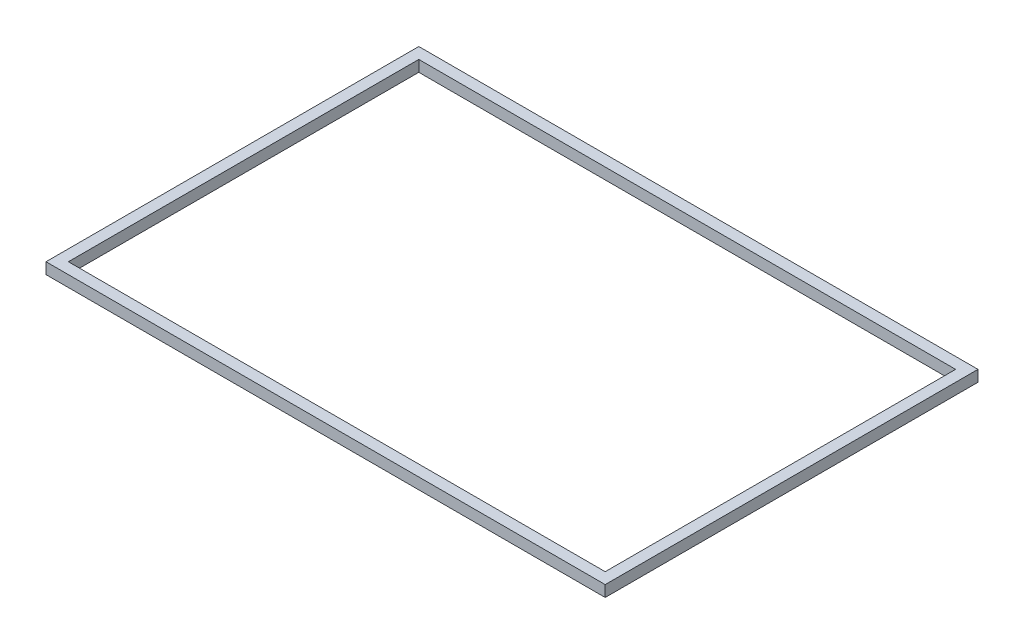
ISO-10303-21;
HEADER;
FILE_DESCRIPTION(('STEP AP214'),'2;1');
FILE_NAME('part.step','',(''),(''),'','','');
FILE_SCHEMA(('AUTOMOTIVE_DESIGN { 1 0 10303 214 1 1 1 1 }'));
ENDSEC;
DATA;
#1=APPLICATION_CONTEXT('core data for automotive mechanical design processes');
#2=APPLICATION_PROTOCOL_DEFINITION('international standard','automotive_design',2000,#1);
#3=PRODUCT_CONTEXT('',#1,'mechanical');
#4=PRODUCT('Part','Part','',(#3));
#5=PRODUCT_RELATED_PRODUCT_CATEGORY('part','',(#4));
#6=PRODUCT_DEFINITION_FORMATION('','',#4);
#7=PRODUCT_DEFINITION_CONTEXT('part definition',#1,'design');
#8=PRODUCT_DEFINITION('design','',#6,#7);
#9=PRODUCT_DEFINITION_SHAPE('','',#8);
#10=(LENGTH_UNIT() NAMED_UNIT(*) SI_UNIT(.MILLI.,.METRE.));
#11=(NAMED_UNIT(*) PLANE_ANGLE_UNIT() SI_UNIT($,.RADIAN.));
#12=(NAMED_UNIT(*) SI_UNIT($,.STERADIAN.) SOLID_ANGLE_UNIT());
#13=UNCERTAINTY_MEASURE_WITH_UNIT(LENGTH_MEASURE(1.E-05),#10,'distance_accuracy_value','');
#14=(GEOMETRIC_REPRESENTATION_CONTEXT(3) GLOBAL_UNCERTAINTY_ASSIGNED_CONTEXT((#13)) GLOBAL_UNIT_ASSIGNED_CONTEXT((#10,
#11,#12)) REPRESENTATION_CONTEXT('',''));
#15=CARTESIAN_POINT('',(0.,0.,0.));
#16=DIRECTION('',(0.,0.,1.));
#17=DIRECTION('',(1.,0.,0.));
#18=AXIS2_PLACEMENT_3D('',#15,#16,#17);
#19=CARTESIAN_POINT('',(0.,3.,0.));
#20=DIRECTION('',(0.,0.,-1.));
#21=DIRECTION('',(-1.,0.,0.));
#22=AXIS2_PLACEMENT_3D('',#19,#20,#21);
#23=PLANE('',#22);
#24=DIRECTION('',(1.,0.,0.));
#25=VECTOR('',#24,1.);
#26=CARTESIAN_POINT('',(0.,0.,0.));
#27=LINE('',#26,#25);
#28=CARTESIAN_POINT('',(0.,0.,0.));
#29=VERTEX_POINT('',#28);
#30=CARTESIAN_POINT('',(150.,0.,0.));
#31=VERTEX_POINT('',#30);
#32=EDGE_CURVE('E140',#29,#31,#27,.T.);
#33=ORIENTED_EDGE('',*,*,#32,.T.);
#34=DIRECTION('',(0.,-1.,0.));
#35=VECTOR('',#34,1.);
#36=CARTESIAN_POINT('',(150.,3.,0.));
#37=LINE('',#36,#35);
#38=CARTESIAN_POINT('',(150.,3.,0.));
#39=VERTEX_POINT('',#38);
#40=EDGE_CURVE('E11',#39,#31,#37,.T.);
#41=ORIENTED_EDGE('',*,*,#40,.F.);
#42=DIRECTION('',(1.,0.,0.));
#43=VECTOR('',#42,1.);
#44=CARTESIAN_POINT('',(0.,3.,0.));
#45=LINE('',#44,#43);
#46=CARTESIAN_POINT('',(0.,3.,0.));
#47=VERTEX_POINT('',#46);
#48=EDGE_CURVE('E112',#47,#39,#45,.T.);
#49=ORIENTED_EDGE('',*,*,#48,.F.);
#50=DIRECTION('',(0.,-1.,0.));
#51=VECTOR('',#50,1.);
#52=CARTESIAN_POINT('',(0.,3.,0.));
#53=LINE('',#52,#51);
#54=EDGE_CURVE('E52',#47,#29,#53,.T.);
#55=ORIENTED_EDGE('',*,*,#54,.T.);
#56=EDGE_LOOP('',(#33,#41,#49,#55));
#57=FACE_BOUND('',#56,.T.);
#58=ADVANCED_FACE('F33',(#57),#23,.F.);
#59=CARTESIAN_POINT('',(150.,3.,0.));
#60=DIRECTION('',(-1.,0.,0.));
#61=DIRECTION('',(0.,0.,1.));
#62=AXIS2_PLACEMENT_3D('',#59,#60,#61);
#63=PLANE('',#62);
#64=DIRECTION('',(0.,0.,-1.));
#65=VECTOR('',#64,1.);
#66=CARTESIAN_POINT('',(150.,0.,0.));
#67=LINE('',#66,#65);
#68=CARTESIAN_POINT('',(150.,0.,-100.));
#69=VERTEX_POINT('',#68);
#70=EDGE_CURVE('E118',#31,#69,#67,.T.);
#71=ORIENTED_EDGE('',*,*,#70,.T.);
#72=DIRECTION('',(0.,-1.,0.));
#73=VECTOR('',#72,1.);
#74=CARTESIAN_POINT('',(150.,3.,-100.));
#75=LINE('',#74,#73);
#76=CARTESIAN_POINT('',(150.,3.,-100.));
#77=VERTEX_POINT('',#76);
#78=EDGE_CURVE('E43',#77,#69,#75,.T.);
#79=ORIENTED_EDGE('',*,*,#78,.F.);
#80=DIRECTION('',(0.,0.,-1.));
#81=VECTOR('',#80,1.);
#82=CARTESIAN_POINT('',(150.,3.,0.));
#83=LINE('',#82,#81);
#84=EDGE_CURVE('E106',#39,#77,#83,.T.);
#85=ORIENTED_EDGE('',*,*,#84,.F.);
#86=ORIENTED_EDGE('',*,*,#40,.T.);
#87=EDGE_LOOP('',(#71,#79,#85,#86));
#88=FACE_BOUND('',#87,.T.);
#89=ADVANCED_FACE('F117',(#88),#63,.F.);
#90=CARTESIAN_POINT('',(0.,3.,-100.));
#91=DIRECTION('',(0.,0.,-1.));
#92=DIRECTION('',(-1.,0.,0.));
#93=AXIS2_PLACEMENT_3D('',#90,#91,#92);
#94=PLANE('',#93);
#95=DIRECTION('',(1.,0.,0.));
#96=VECTOR('',#95,1.);
#97=CARTESIAN_POINT('',(0.,0.,-100.));
#98=LINE('',#97,#96);
#99=CARTESIAN_POINT('',(0.,0.,-100.));
#100=VERTEX_POINT('',#99);
#101=EDGE_CURVE('E143',#100,#69,#98,.T.);
#102=ORIENTED_EDGE('',*,*,#101,.F.);
#103=DIRECTION('',(0.,-1.,0.));
#104=VECTOR('',#103,1.);
#105=CARTESIAN_POINT('',(0.,3.,-100.));
#106=LINE('',#105,#104);
#107=CARTESIAN_POINT('',(0.,3.,-100.));
#108=VERTEX_POINT('',#107);
#109=EDGE_CURVE('E78',#108,#100,#106,.T.);
#110=ORIENTED_EDGE('',*,*,#109,.F.);
#111=DIRECTION('',(1.,0.,0.));
#112=VECTOR('',#111,1.);
#113=CARTESIAN_POINT('',(0.,3.,-100.));
#114=LINE('',#113,#112);
#115=EDGE_CURVE('E111',#108,#77,#114,.T.);
#116=ORIENTED_EDGE('',*,*,#115,.T.);
#117=ORIENTED_EDGE('',*,*,#78,.T.);
#118=EDGE_LOOP('',(#102,#110,#116,#117));
#119=FACE_BOUND('',#118,.T.);
#120=ADVANCED_FACE('F122',(#119),#94,.T.);
#121=CARTESIAN_POINT('',(0.,3.,-3.));
#122=DIRECTION('',(0.,0.,-1.));
#123=DIRECTION('',(-1.,0.,0.));
#124=AXIS2_PLACEMENT_3D('',#121,#122,#123);
#125=PLANE('',#124);
#126=DIRECTION('',(1.,0.,0.));
#127=VECTOR('',#126,1.);
#128=CARTESIAN_POINT('',(0.,0.,-3.));
#129=LINE('',#128,#127);
#130=CARTESIAN_POINT('',(3.,0.,-3.));
#131=VERTEX_POINT('',#130);
#132=CARTESIAN_POINT('',(147.,0.,-3.));
#133=VERTEX_POINT('',#132);
#134=EDGE_CURVE('E129',#131,#133,#129,.T.);
#135=ORIENTED_EDGE('',*,*,#134,.F.);
#136=DIRECTION('',(0.,-1.,0.));
#137=VECTOR('',#136,1.);
#138=CARTESIAN_POINT('',(3.,3.,-3.));
#139=LINE('',#138,#137);
#140=CARTESIAN_POINT('',(3.,3.,-3.));
#141=VERTEX_POINT('',#140);
#142=EDGE_CURVE('E37',#141,#131,#139,.T.);
#143=ORIENTED_EDGE('',*,*,#142,.F.);
#144=DIRECTION('',(1.,0.,0.));
#145=VECTOR('',#144,1.);
#146=CARTESIAN_POINT('',(0.,3.,-3.));
#147=LINE('',#146,#145);
#148=CARTESIAN_POINT('',(147.,3.,-3.));
#149=VERTEX_POINT('',#148);
#150=EDGE_CURVE('E148',#141,#149,#147,.T.);
#151=ORIENTED_EDGE('',*,*,#150,.T.);
#152=DIRECTION('',(0.,-1.,0.));
#153=VECTOR('',#152,1.);
#154=CARTESIAN_POINT('',(147.,3.,-3.));
#155=LINE('',#154,#153);
#156=EDGE_CURVE('E125',#149,#133,#155,.T.);
#157=ORIENTED_EDGE('',*,*,#156,.T.);
#158=EDGE_LOOP('',(#135,#143,#151,#157));
#159=FACE_BOUND('',#158,.T.);
#160=ADVANCED_FACE('F35',(#159),#125,.T.);
#161=CARTESIAN_POINT('',(3.,3.,0.));
#162=DIRECTION('',(-1.,0.,0.));
#163=DIRECTION('',(0.,0.,1.));
#164=AXIS2_PLACEMENT_3D('',#161,#162,#163);
#165=PLANE('',#164);
#166=DIRECTION('',(0.,0.,-1.));
#167=VECTOR('',#166,1.);
#168=CARTESIAN_POINT('',(3.,0.,0.));
#169=LINE('',#168,#167);
#170=CARTESIAN_POINT('',(3.,0.,-97.));
#171=VERTEX_POINT('',#170);
#172=EDGE_CURVE('E132',#131,#171,#169,.T.);
#173=ORIENTED_EDGE('',*,*,#172,.T.);
#174=DIRECTION('',(0.,-1.,0.));
#175=VECTOR('',#174,1.);
#176=CARTESIAN_POINT('',(3.,3.,-97.));
#177=LINE('',#176,#175);
#178=CARTESIAN_POINT('',(3.,3.,-97.));
#179=VERTEX_POINT('',#178);
#180=EDGE_CURVE('E153',#179,#171,#177,.T.);
#181=ORIENTED_EDGE('',*,*,#180,.F.);
#182=DIRECTION('',(0.,0.,-1.));
#183=VECTOR('',#182,1.);
#184=CARTESIAN_POINT('',(3.,3.,0.));
#185=LINE('',#184,#183);
#186=EDGE_CURVE('E162',#141,#179,#185,.T.);
#187=ORIENTED_EDGE('',*,*,#186,.F.);
#188=ORIENTED_EDGE('',*,*,#142,.T.);
#189=EDGE_LOOP('',(#173,#181,#187,#188));
#190=FACE_BOUND('',#189,.T.);
#191=ADVANCED_FACE('F161',(#190),#165,.F.);
#192=CARTESIAN_POINT('',(0.,3.,-97.));
#193=DIRECTION('',(0.,0.,-1.));
#194=DIRECTION('',(-1.,0.,0.));
#195=AXIS2_PLACEMENT_3D('',#192,#193,#194);
#196=PLANE('',#195);
#197=DIRECTION('',(1.,0.,0.));
#198=VECTOR('',#197,1.);
#199=CARTESIAN_POINT('',(0.,0.,-97.));
#200=LINE('',#199,#198);
#201=CARTESIAN_POINT('',(147.,0.,-97.));
#202=VERTEX_POINT('',#201);
#203=EDGE_CURVE('E134',#171,#202,#200,.T.);
#204=ORIENTED_EDGE('',*,*,#203,.T.);
#205=DIRECTION('',(0.,-1.,0.));
#206=VECTOR('',#205,1.);
#207=CARTESIAN_POINT('',(147.,3.,-97.));
#208=LINE('',#207,#206);
#209=CARTESIAN_POINT('',(147.,3.,-97.));
#210=VERTEX_POINT('',#209);
#211=EDGE_CURVE('E152',#210,#202,#208,.T.);
#212=ORIENTED_EDGE('',*,*,#211,.F.);
#213=DIRECTION('',(1.,0.,0.));
#214=VECTOR('',#213,1.);
#215=CARTESIAN_POINT('',(0.,3.,-97.));
#216=LINE('',#215,#214);
#217=EDGE_CURVE('E201',#179,#210,#216,.T.);
#218=ORIENTED_EDGE('',*,*,#217,.F.);
#219=ORIENTED_EDGE('',*,*,#180,.T.);
#220=EDGE_LOOP('',(#204,#212,#218,#219));
#221=FACE_BOUND('',#220,.T.);
#222=ADVANCED_FACE('F174',(#221),#196,.F.);
#223=CARTESIAN_POINT('',(147.,3.,0.));
#224=DIRECTION('',(-1.,0.,0.));
#225=DIRECTION('',(0.,0.,1.));
#226=AXIS2_PLACEMENT_3D('',#223,#224,#225);
#227=PLANE('',#226);
#228=DIRECTION('',(0.,0.,-1.));
#229=VECTOR('',#228,1.);
#230=CARTESIAN_POINT('',(147.,0.,0.));
#231=LINE('',#230,#229);
#232=EDGE_CURVE('E137',#133,#202,#231,.T.);
#233=ORIENTED_EDGE('',*,*,#232,.F.);
#234=ORIENTED_EDGE('',*,*,#156,.F.);
#235=DIRECTION('',(0.,0.,-1.));
#236=VECTOR('',#235,1.);
#237=CARTESIAN_POINT('',(147.,3.,0.));
#238=LINE('',#237,#236);
#239=EDGE_CURVE('E172',#149,#210,#238,.T.);
#240=ORIENTED_EDGE('',*,*,#239,.T.);
#241=ORIENTED_EDGE('',*,*,#211,.T.);
#242=EDGE_LOOP('',(#233,#234,#240,#241));
#243=FACE_BOUND('',#242,.T.);
#244=ADVANCED_FACE('F171',(#243),#227,.T.);
#245=CARTESIAN_POINT('',(0.,3.,0.));
#246=DIRECTION('',(-1.,0.,0.));
#247=DIRECTION('',(0.,0.,1.));
#248=AXIS2_PLACEMENT_3D('',#245,#246,#247);
#249=PLANE('',#248);
#250=DIRECTION('',(0.,0.,-1.));
#251=VECTOR('',#250,1.);
#252=CARTESIAN_POINT('',(0.,0.,0.));
#253=LINE('',#252,#251);
#254=EDGE_CURVE('E145',#29,#100,#253,.T.);
#255=ORIENTED_EDGE('',*,*,#254,.F.);
#256=ORIENTED_EDGE('',*,*,#54,.F.);
#257=DIRECTION('',(0.,0.,-1.));
#258=VECTOR('',#257,1.);
#259=CARTESIAN_POINT('',(0.,3.,0.));
#260=LINE('',#259,#258);
#261=EDGE_CURVE('E123',#47,#108,#260,.T.);
#262=ORIENTED_EDGE('',*,*,#261,.T.);
#263=ORIENTED_EDGE('',*,*,#109,.T.);
#264=EDGE_LOOP('',(#255,#256,#262,#263));
#265=FACE_BOUND('',#264,.T.);
#266=ADVANCED_FACE('F181',(#265),#249,.T.);
#267=CARTESIAN_POINT('',(0.,3.,0.));
#268=DIRECTION('',(0.,1.,0.));
#269=DIRECTION('',(0.,0.,1.));
#270=AXIS2_PLACEMENT_3D('',#267,#268,#269);
#271=PLANE('',#270);
#272=ORIENTED_EDGE('',*,*,#150,.F.);
#273=ORIENTED_EDGE('',*,*,#186,.T.);
#274=ORIENTED_EDGE('',*,*,#217,.T.);
#275=ORIENTED_EDGE('',*,*,#239,.F.);
#276=EDGE_LOOP('',(#272,#273,#274,#275));
#277=FACE_BOUND('',#276,.T.);
#278=ORIENTED_EDGE('',*,*,#48,.T.);
#279=ORIENTED_EDGE('',*,*,#84,.T.);
#280=ORIENTED_EDGE('',*,*,#115,.F.);
#281=ORIENTED_EDGE('',*,*,#261,.F.);
#282=EDGE_LOOP('',(#278,#279,#280,#281));
#283=FACE_BOUND('',#282,.T.);
#284=ADVANCED_FACE('F108',(#277,#283),#271,.T.);
#285=CARTESIAN_POINT('',(0.,0.,0.));
#286=DIRECTION('',(0.,1.,0.));
#287=DIRECTION('',(0.,0.,1.));
#288=AXIS2_PLACEMENT_3D('',#285,#286,#287);
#289=PLANE('',#288);
#290=ORIENTED_EDGE('',*,*,#134,.T.);
#291=ORIENTED_EDGE('',*,*,#232,.T.);
#292=ORIENTED_EDGE('',*,*,#203,.F.);
#293=ORIENTED_EDGE('',*,*,#172,.F.);
#294=EDGE_LOOP('',(#290,#291,#292,#293));
#295=FACE_BOUND('',#294,.T.);
#296=ORIENTED_EDGE('',*,*,#32,.F.);
#297=ORIENTED_EDGE('',*,*,#254,.T.);
#298=ORIENTED_EDGE('',*,*,#101,.T.);
#299=ORIENTED_EDGE('',*,*,#70,.F.);
#300=EDGE_LOOP('',(#296,#297,#298,#299));
#301=FACE_BOUND('',#300,.T.);
#302=ADVANCED_FACE('F165',(#295,#301),#289,.F.);
#303=CLOSED_SHELL('',(#58,#89,#120,#160,#191,#222,#244,#266,#284,#302));
#304=MANIFOLD_SOLID_BREP('B2',#303);
#305=ADVANCED_BREP_SHAPE_REPRESENTATION('',(#18,#304),#14);
#306=SHAPE_DEFINITION_REPRESENTATION(#9,#305);
ENDSEC;
END-ISO-10303-21;
